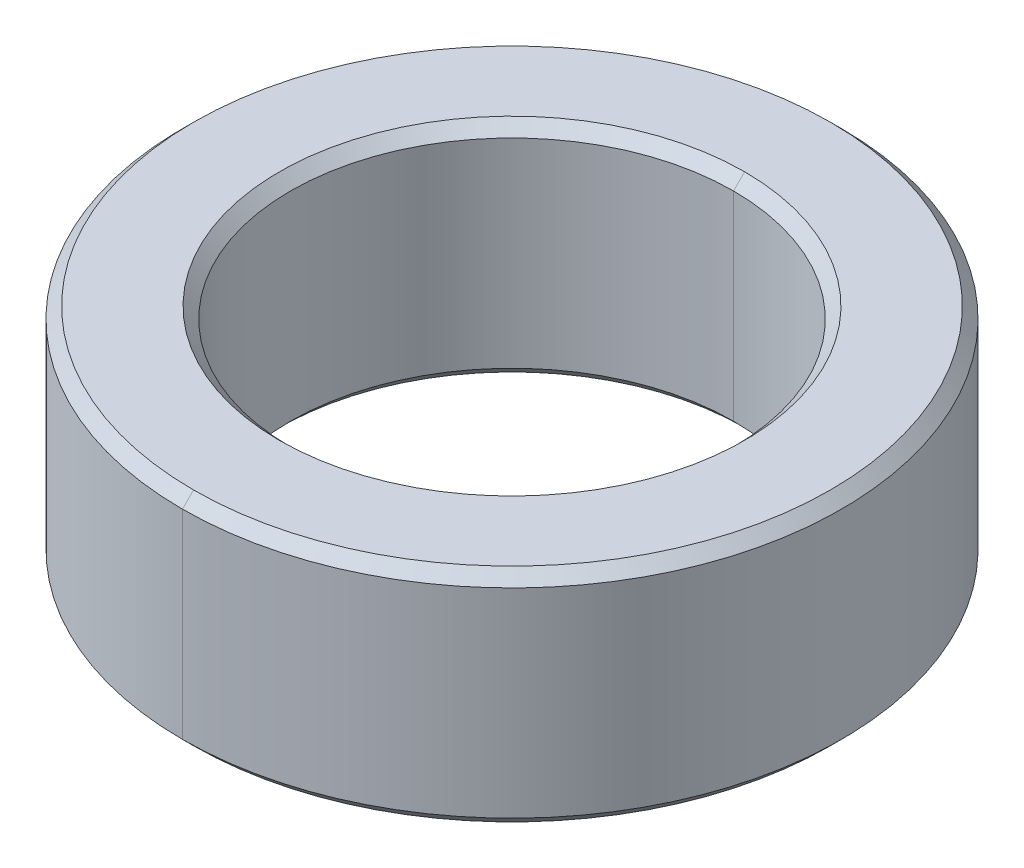
ISO-10303-21;
HEADER;
FILE_DESCRIPTION(('STEP AP214'),'2;1');
FILE_NAME('part.step','',(''),(''),'','','');
FILE_SCHEMA(('AUTOMOTIVE_DESIGN { 1 0 10303 214 1 1 1 1 }'));
ENDSEC;
DATA;
#1=APPLICATION_CONTEXT('core data for automotive mechanical design processes');
#2=APPLICATION_PROTOCOL_DEFINITION('international standard','automotive_design',2000,#1);
#3=PRODUCT_CONTEXT('',#1,'mechanical');
#4=PRODUCT('Part','Part','',(#3));
#5=PRODUCT_RELATED_PRODUCT_CATEGORY('part','',(#4));
#6=PRODUCT_DEFINITION_FORMATION('','',#4);
#7=PRODUCT_DEFINITION_CONTEXT('part definition',#1,'design');
#8=PRODUCT_DEFINITION('design','',#6,#7);
#9=PRODUCT_DEFINITION_SHAPE('','',#8);
#10=(LENGTH_UNIT() NAMED_UNIT(*) SI_UNIT(.MILLI.,.METRE.));
#11=(NAMED_UNIT(*) PLANE_ANGLE_UNIT() SI_UNIT($,.RADIAN.));
#12=(NAMED_UNIT(*) SI_UNIT($,.STERADIAN.) SOLID_ANGLE_UNIT());
#13=UNCERTAINTY_MEASURE_WITH_UNIT(LENGTH_MEASURE(1.E-05),#10,'distance_accuracy_value','');
#14=(GEOMETRIC_REPRESENTATION_CONTEXT(3) GLOBAL_UNCERTAINTY_ASSIGNED_CONTEXT((#13)) GLOBAL_UNIT_ASSIGNED_CONTEXT((#10,
#11,#12)) REPRESENTATION_CONTEXT('',''));
#15=CARTESIAN_POINT('',(0.,0.,0.));
#16=DIRECTION('',(0.,0.,1.));
#17=DIRECTION('',(1.,0.,0.));
#18=AXIS2_PLACEMENT_3D('',#15,#16,#17);
#19=CARTESIAN_POINT('',(0.,0.9,0.));
#20=DIRECTION('',(0.,1.,0.));
#21=DIRECTION('',(0.,0.,1.));
#22=AXIS2_PLACEMENT_3D('',#19,#20,#21);
#23=CONICAL_SURFACE('',#22,2.,0.785398163397459);
#24=DIRECTION('',(0.,0.70710678118654,-0.707106781186555));
#25=VECTOR('',#24,1.);
#26=CARTESIAN_POINT('',(0.,0.9,-2.));
#27=LINE('',#26,#25);
#28=CARTESIAN_POINT('',(0.,0.9,-2.));
#29=VERTEX_POINT('',#28);
#30=CARTESIAN_POINT('',(0.,1.,-2.1));
#31=VERTEX_POINT('',#30);
#32=EDGE_CURVE('E158',#29,#31,#27,.T.);
#33=ORIENTED_EDGE('',*,*,#32,.F.);
#34=CARTESIAN_POINT('',(0.,0.9,0.));
#35=DIRECTION('',(0.,1.,0.));
#36=DIRECTION('',(0.,0.,1.));
#37=AXIS2_PLACEMENT_3D('',#34,#35,#36);
#38=CIRCLE('',#37,2.);
#39=CARTESIAN_POINT('',(0.,0.9,2.));
#40=VERTEX_POINT('',#39);
#41=EDGE_CURVE('E27',#40,#29,#38,.T.);
#42=ORIENTED_EDGE('',*,*,#41,.F.);
#43=DIRECTION('',(0.,0.70710678118654,0.707106781186555));
#44=VECTOR('',#43,1.);
#45=CARTESIAN_POINT('',(0.,0.9,2.));
#46=LINE('',#45,#44);
#47=CARTESIAN_POINT('',(0.,1.,2.1));
#48=VERTEX_POINT('',#47);
#49=EDGE_CURVE('E114',#40,#48,#46,.T.);
#50=ORIENTED_EDGE('',*,*,#49,.T.);
#51=CARTESIAN_POINT('',(0.,1.,0.));
#52=DIRECTION('',(0.,-1.,0.));
#53=DIRECTION('',(0.,0.,1.));
#54=AXIS2_PLACEMENT_3D('',#51,#52,#53);
#55=CIRCLE('',#54,2.1);
#56=EDGE_CURVE('E20',#31,#48,#55,.T.);
#57=ORIENTED_EDGE('',*,*,#56,.F.);
#58=EDGE_LOOP('',(#33,#42,#50,#57));
#59=FACE_BOUND('',#58,.T.);
#60=ADVANCED_FACE('F16',(#59),#23,.F.);
#61=CARTESIAN_POINT('',(0.,-1.,0.));
#62=DIRECTION('',(0.,-1.,0.));
#63=DIRECTION('',(0.,0.,-1.));
#64=AXIS2_PLACEMENT_3D('',#61,#62,#63);
#65=CONICAL_SURFACE('',#64,2.1,0.785398163397448);
#66=DIRECTION('',(0.,-0.707106781186548,0.707106781186548));
#67=VECTOR('',#66,1.);
#68=CARTESIAN_POINT('',(0.,-1.,2.1));
#69=LINE('',#68,#67);
#70=CARTESIAN_POINT('',(0.,-0.9,2.));
#71=VERTEX_POINT('',#70);
#72=CARTESIAN_POINT('',(0.,-1.,2.1));
#73=VERTEX_POINT('',#72);
#74=EDGE_CURVE('E101',#71,#73,#69,.T.);
#75=ORIENTED_EDGE('',*,*,#74,.F.);
#76=CARTESIAN_POINT('',(0.,-0.9,0.));
#77=DIRECTION('',(0.,-1.,0.));
#78=DIRECTION('',(0.,0.,1.));
#79=AXIS2_PLACEMENT_3D('',#76,#77,#78);
#80=CIRCLE('',#79,2.);
#81=CARTESIAN_POINT('',(0.,-0.9,-2.));
#82=VERTEX_POINT('',#81);
#83=EDGE_CURVE('E10',#82,#71,#80,.T.);
#84=ORIENTED_EDGE('',*,*,#83,.F.);
#85=DIRECTION('',(0.,-0.707106781186548,-0.707106781186548));
#86=VECTOR('',#85,1.);
#87=CARTESIAN_POINT('',(0.,-1.,-2.1));
#88=LINE('',#87,#86);
#89=CARTESIAN_POINT('',(0.,-1.,-2.1));
#90=VERTEX_POINT('',#89);
#91=EDGE_CURVE('E112',#82,#90,#88,.T.);
#92=ORIENTED_EDGE('',*,*,#91,.T.);
#93=CARTESIAN_POINT('',(0.,-1.,0.));
#94=DIRECTION('',(0.,1.,0.));
#95=DIRECTION('',(0.,0.,1.));
#96=AXIS2_PLACEMENT_3D('',#93,#94,#95);
#97=CIRCLE('',#96,2.1);
#98=EDGE_CURVE('E104',#73,#90,#97,.T.);
#99=ORIENTED_EDGE('',*,*,#98,.F.);
#100=EDGE_LOOP('',(#75,#84,#92,#99));
#101=FACE_BOUND('',#100,.T.);
#102=ADVANCED_FACE('F102',(#101),#65,.F.);
#103=CARTESIAN_POINT('',(0.,1.,0.));
#104=DIRECTION('',(0.,-1.,0.));
#105=DIRECTION('',(0.,0.,-1.));
#106=AXIS2_PLACEMENT_3D('',#103,#104,#105);
#107=CONICAL_SURFACE('',#106,2.875,0.785398163397448);
#108=DIRECTION('',(0.,-0.707106781186548,0.707106781186548));
#109=VECTOR('',#108,1.);
#110=CARTESIAN_POINT('',(0.,1.,2.875));
#111=LINE('',#110,#109);
#112=CARTESIAN_POINT('',(0.,1.,2.875));
#113=VERTEX_POINT('',#112);
#114=CARTESIAN_POINT('',(0.,0.9,2.975));
#115=VERTEX_POINT('',#114);
#116=EDGE_CURVE('E136',#113,#115,#111,.T.);
#117=ORIENTED_EDGE('',*,*,#116,.F.);
#118=CARTESIAN_POINT('',(0.,1.,0.));
#119=DIRECTION('',(0.,1.,0.));
#120=DIRECTION('',(0.,0.,1.));
#121=AXIS2_PLACEMENT_3D('',#118,#119,#120);
#122=CIRCLE('',#121,2.875);
#123=CARTESIAN_POINT('',(0.,1.,-2.875));
#124=VERTEX_POINT('',#123);
#125=EDGE_CURVE('E129',#124,#113,#122,.T.);
#126=ORIENTED_EDGE('',*,*,#125,.F.);
#127=DIRECTION('',(0.,-0.707106781186548,-0.707106781186548));
#128=VECTOR('',#127,1.);
#129=CARTESIAN_POINT('',(0.,1.,-2.875));
#130=LINE('',#129,#128);
#131=CARTESIAN_POINT('',(0.,0.9,-2.975));
#132=VERTEX_POINT('',#131);
#133=EDGE_CURVE('E135',#124,#132,#130,.T.);
#134=ORIENTED_EDGE('',*,*,#133,.T.);
#135=CARTESIAN_POINT('',(0.,0.9,0.));
#136=DIRECTION('',(0.,-1.,0.));
#137=DIRECTION('',(0.,0.,1.));
#138=AXIS2_PLACEMENT_3D('',#135,#136,#137);
#139=CIRCLE('',#138,2.975);
#140=EDGE_CURVE('E155',#115,#132,#139,.T.);
#141=ORIENTED_EDGE('',*,*,#140,.F.);
#142=EDGE_LOOP('',(#117,#126,#134,#141));
#143=FACE_BOUND('',#142,.T.);
#144=ADVANCED_FACE('F203',(#143),#107,.T.);
#145=CARTESIAN_POINT('',(0.,-0.9,0.));
#146=DIRECTION('',(0.,1.,0.));
#147=DIRECTION('',(0.,0.,1.));
#148=AXIS2_PLACEMENT_3D('',#145,#146,#147);
#149=CONICAL_SURFACE('',#148,2.975,0.785398163397453);
#150=DIRECTION('',(0.,0.707106781186544,-0.707106781186551));
#151=VECTOR('',#150,1.);
#152=CARTESIAN_POINT('',(0.,-0.9,-2.975));
#153=LINE('',#152,#151);
#154=CARTESIAN_POINT('',(0.,-1.,-2.875));
#155=VERTEX_POINT('',#154);
#156=CARTESIAN_POINT('',(0.,-0.9,-2.975));
#157=VERTEX_POINT('',#156);
#158=EDGE_CURVE('E137',#155,#157,#153,.T.);
#159=ORIENTED_EDGE('',*,*,#158,.F.);
#160=CARTESIAN_POINT('',(0.,-1.,0.));
#161=DIRECTION('',(0.,-1.,0.));
#162=DIRECTION('',(0.,0.,1.));
#163=AXIS2_PLACEMENT_3D('',#160,#161,#162);
#164=CIRCLE('',#163,2.875);
#165=CARTESIAN_POINT('',(0.,-1.,2.875));
#166=VERTEX_POINT('',#165);
#167=EDGE_CURVE('E162',#166,#155,#164,.T.);
#168=ORIENTED_EDGE('',*,*,#167,.F.);
#169=DIRECTION('',(0.,0.707106781186544,0.707106781186551));
#170=VECTOR('',#169,1.);
#171=CARTESIAN_POINT('',(0.,-0.9,2.975));
#172=LINE('',#171,#170);
#173=CARTESIAN_POINT('',(0.,-0.9,2.975));
#174=VERTEX_POINT('',#173);
#175=EDGE_CURVE('E97',#166,#174,#172,.T.);
#176=ORIENTED_EDGE('',*,*,#175,.T.);
#177=CARTESIAN_POINT('',(0.,-0.9,0.));
#178=DIRECTION('',(0.,1.,0.));
#179=DIRECTION('',(0.,0.,1.));
#180=AXIS2_PLACEMENT_3D('',#177,#178,#179);
#181=CIRCLE('',#180,2.975);
#182=EDGE_CURVE('E42',#157,#174,#181,.T.);
#183=ORIENTED_EDGE('',*,*,#182,.F.);
#184=EDGE_LOOP('',(#159,#168,#176,#183));
#185=FACE_BOUND('',#184,.T.);
#186=ADVANCED_FACE('F18',(#185),#149,.T.);
#187=CARTESIAN_POINT('',(0.,1.,0.));
#188=DIRECTION('',(0.,-1.,0.));
#189=DIRECTION('',(0.,0.,-1.));
#190=AXIS2_PLACEMENT_3D('',#187,#188,#189);
#191=CYLINDRICAL_SURFACE('',#190,2.);
#192=DIRECTION('',(0.,-1.,0.));
#193=VECTOR('',#192,1.);
#194=CARTESIAN_POINT('',(0.,1.,2.));
#195=LINE('',#194,#193);
#196=EDGE_CURVE('E80',#40,#71,#195,.T.);
#197=ORIENTED_EDGE('',*,*,#196,.F.);
#198=ORIENTED_EDGE('',*,*,#41,.T.);
#199=DIRECTION('',(0.,-1.,0.));
#200=VECTOR('',#199,1.);
#201=CARTESIAN_POINT('',(0.,1.,-2.));
#202=LINE('',#201,#200);
#203=EDGE_CURVE('E83',#29,#82,#202,.T.);
#204=ORIENTED_EDGE('',*,*,#203,.T.);
#205=ORIENTED_EDGE('',*,*,#83,.T.);
#206=EDGE_LOOP('',(#197,#198,#204,#205));
#207=FACE_BOUND('',#206,.T.);
#208=ADVANCED_FACE('F77',(#207),#191,.F.);
#209=CARTESIAN_POINT('',(0.,1.,0.));
#210=DIRECTION('',(0.,-1.,0.));
#211=DIRECTION('',(0.,0.,-1.));
#212=AXIS2_PLACEMENT_3D('',#209,#210,#211);
#213=CYLINDRICAL_SURFACE('',#212,2.975);
#214=DIRECTION('',(0.,-1.,0.));
#215=VECTOR('',#214,1.);
#216=CARTESIAN_POINT('',(0.,1.,2.975));
#217=LINE('',#216,#215);
#218=EDGE_CURVE('E130',#115,#174,#217,.T.);
#219=ORIENTED_EDGE('',*,*,#218,.F.);
#220=ORIENTED_EDGE('',*,*,#140,.T.);
#221=DIRECTION('',(0.,-1.,0.));
#222=VECTOR('',#221,1.);
#223=CARTESIAN_POINT('',(0.,1.,-2.975));
#224=LINE('',#223,#222);
#225=EDGE_CURVE('E127',#132,#157,#224,.T.);
#226=ORIENTED_EDGE('',*,*,#225,.T.);
#227=ORIENTED_EDGE('',*,*,#182,.T.);
#228=EDGE_LOOP('',(#219,#220,#226,#227));
#229=FACE_BOUND('',#228,.T.);
#230=ADVANCED_FACE('F194',(#229),#213,.T.);
#231=CARTESIAN_POINT('',(0.,-1.,0.));
#232=DIRECTION('',(0.,1.,0.));
#233=DIRECTION('',(1.,0.,0.));
#234=AXIS2_PLACEMENT_3D('',#231,#232,#233);
#235=PLANE('',#234);
#236=CARTESIAN_POINT('',(0.,-1.,0.));
#237=DIRECTION('',(0.,1.,0.));
#238=DIRECTION('',(0.,0.,1.));
#239=AXIS2_PLACEMENT_3D('',#236,#237,#238);
#240=CIRCLE('',#239,2.1);
#241=EDGE_CURVE('E109',#90,#73,#240,.T.);
#242=ORIENTED_EDGE('',*,*,#241,.T.);
#243=ORIENTED_EDGE('',*,*,#98,.T.);
#244=EDGE_LOOP('',(#242,#243));
#245=FACE_BOUND('',#244,.T.);
#246=ORIENTED_EDGE('',*,*,#167,.T.);
#247=CARTESIAN_POINT('',(0.,-1.,0.));
#248=DIRECTION('',(0.,-1.,0.));
#249=DIRECTION('',(0.,0.,1.));
#250=AXIS2_PLACEMENT_3D('',#247,#248,#249);
#251=CIRCLE('',#250,2.875);
#252=EDGE_CURVE('E142',#155,#166,#251,.T.);
#253=ORIENTED_EDGE('',*,*,#252,.T.);
#254=EDGE_LOOP('',(#246,#253));
#255=FACE_BOUND('',#254,.T.);
#256=ADVANCED_FACE('F235',(#245,#255),#235,.F.);
#257=CARTESIAN_POINT('',(0.,1.,0.));
#258=DIRECTION('',(0.,1.,0.));
#259=DIRECTION('',(1.,0.,0.));
#260=AXIS2_PLACEMENT_3D('',#257,#258,#259);
#261=PLANE('',#260);
#262=CARTESIAN_POINT('',(0.,1.,0.));
#263=DIRECTION('',(0.,-1.,0.));
#264=DIRECTION('',(0.,0.,1.));
#265=AXIS2_PLACEMENT_3D('',#262,#263,#264);
#266=CIRCLE('',#265,2.1);
#267=EDGE_CURVE('E122',#48,#31,#266,.T.);
#268=ORIENTED_EDGE('',*,*,#267,.T.);
#269=ORIENTED_EDGE('',*,*,#56,.T.);
#270=EDGE_LOOP('',(#268,#269));
#271=FACE_BOUND('',#270,.T.);
#272=ORIENTED_EDGE('',*,*,#125,.T.);
#273=CARTESIAN_POINT('',(0.,1.,0.));
#274=DIRECTION('',(0.,1.,0.));
#275=DIRECTION('',(0.,0.,1.));
#276=AXIS2_PLACEMENT_3D('',#273,#274,#275);
#277=CIRCLE('',#276,2.875);
#278=EDGE_CURVE('E171',#113,#124,#277,.T.);
#279=ORIENTED_EDGE('',*,*,#278,.T.);
#280=EDGE_LOOP('',(#272,#279));
#281=FACE_BOUND('',#280,.T.);
#282=ADVANCED_FACE('F237',(#271,#281),#261,.T.);
#283=CARTESIAN_POINT('',(0.,1.,0.));
#284=DIRECTION('',(0.,-1.,0.));
#285=DIRECTION('',(0.,0.,-1.));
#286=AXIS2_PLACEMENT_3D('',#283,#284,#285);
#287=CYLINDRICAL_SURFACE('',#286,2.975);
#288=CARTESIAN_POINT('',(0.,0.9,0.));
#289=DIRECTION('',(0.,-1.,0.));
#290=DIRECTION('',(0.,0.,1.));
#291=AXIS2_PLACEMENT_3D('',#288,#289,#290);
#292=CIRCLE('',#291,2.975);
#293=EDGE_CURVE('E131',#132,#115,#292,.T.);
#294=ORIENTED_EDGE('',*,*,#293,.T.);
#295=ORIENTED_EDGE('',*,*,#218,.T.);
#296=CARTESIAN_POINT('',(0.,-0.9,0.));
#297=DIRECTION('',(0.,1.,0.));
#298=DIRECTION('',(0.,0.,1.));
#299=AXIS2_PLACEMENT_3D('',#296,#297,#298);
#300=CIRCLE('',#299,2.975);
#301=EDGE_CURVE('E141',#174,#157,#300,.T.);
#302=ORIENTED_EDGE('',*,*,#301,.T.);
#303=ORIENTED_EDGE('',*,*,#225,.F.);
#304=EDGE_LOOP('',(#294,#295,#302,#303));
#305=FACE_BOUND('',#304,.T.);
#306=ADVANCED_FACE('F199',(#305),#287,.T.);
#307=CARTESIAN_POINT('',(0.,1.,0.));
#308=DIRECTION('',(0.,-1.,0.));
#309=DIRECTION('',(0.,0.,-1.));
#310=AXIS2_PLACEMENT_3D('',#307,#308,#309);
#311=CYLINDRICAL_SURFACE('',#310,2.);
#312=CARTESIAN_POINT('',(0.,0.9,0.));
#313=DIRECTION('',(0.,1.,0.));
#314=DIRECTION('',(0.,0.,1.));
#315=AXIS2_PLACEMENT_3D('',#312,#313,#314);
#316=CIRCLE('',#315,2.);
#317=EDGE_CURVE('E95',#29,#40,#316,.T.);
#318=ORIENTED_EDGE('',*,*,#317,.T.);
#319=ORIENTED_EDGE('',*,*,#196,.T.);
#320=CARTESIAN_POINT('',(0.,-0.9,0.));
#321=DIRECTION('',(0.,-1.,0.));
#322=DIRECTION('',(0.,0.,1.));
#323=AXIS2_PLACEMENT_3D('',#320,#321,#322);
#324=CIRCLE('',#323,2.);
#325=EDGE_CURVE('E93',#71,#82,#324,.T.);
#326=ORIENTED_EDGE('',*,*,#325,.T.);
#327=ORIENTED_EDGE('',*,*,#203,.F.);
#328=EDGE_LOOP('',(#318,#319,#326,#327));
#329=FACE_BOUND('',#328,.T.);
#330=ADVANCED_FACE('F91',(#329),#311,.F.);
#331=CARTESIAN_POINT('',(0.,-0.9,0.));
#332=DIRECTION('',(0.,1.,0.));
#333=DIRECTION('',(0.,0.,1.));
#334=AXIS2_PLACEMENT_3D('',#331,#332,#333);
#335=CONICAL_SURFACE('',#334,2.975,0.785398163397453);
#336=ORIENTED_EDGE('',*,*,#252,.F.);
#337=ORIENTED_EDGE('',*,*,#158,.T.);
#338=ORIENTED_EDGE('',*,*,#301,.F.);
#339=ORIENTED_EDGE('',*,*,#175,.F.);
#340=EDGE_LOOP('',(#336,#337,#338,#339));
#341=FACE_BOUND('',#340,.T.);
#342=ADVANCED_FACE('F234',(#341),#335,.T.);
#343=CARTESIAN_POINT('',(0.,1.,0.));
#344=DIRECTION('',(0.,-1.,0.));
#345=DIRECTION('',(0.,0.,-1.));
#346=AXIS2_PLACEMENT_3D('',#343,#344,#345);
#347=CONICAL_SURFACE('',#346,2.875,0.785398163397448);
#348=ORIENTED_EDGE('',*,*,#278,.F.);
#349=ORIENTED_EDGE('',*,*,#116,.T.);
#350=ORIENTED_EDGE('',*,*,#293,.F.);
#351=ORIENTED_EDGE('',*,*,#133,.F.);
#352=EDGE_LOOP('',(#348,#349,#350,#351));
#353=FACE_BOUND('',#352,.T.);
#354=ADVANCED_FACE('F206',(#353),#347,.T.);
#355=CARTESIAN_POINT('',(0.,-1.,0.));
#356=DIRECTION('',(0.,-1.,0.));
#357=DIRECTION('',(0.,0.,-1.));
#358=AXIS2_PLACEMENT_3D('',#355,#356,#357);
#359=CONICAL_SURFACE('',#358,2.1,0.785398163397448);
#360=ORIENTED_EDGE('',*,*,#325,.F.);
#361=ORIENTED_EDGE('',*,*,#74,.T.);
#362=ORIENTED_EDGE('',*,*,#241,.F.);
#363=ORIENTED_EDGE('',*,*,#91,.F.);
#364=EDGE_LOOP('',(#360,#361,#362,#363));
#365=FACE_BOUND('',#364,.T.);
#366=ADVANCED_FACE('F111',(#365),#359,.F.);
#367=CARTESIAN_POINT('',(0.,0.9,0.));
#368=DIRECTION('',(0.,1.,0.));
#369=DIRECTION('',(0.,0.,1.));
#370=AXIS2_PLACEMENT_3D('',#367,#368,#369);
#371=CONICAL_SURFACE('',#370,2.,0.785398163397459);
#372=ORIENTED_EDGE('',*,*,#317,.F.);
#373=ORIENTED_EDGE('',*,*,#32,.T.);
#374=ORIENTED_EDGE('',*,*,#267,.F.);
#375=ORIENTED_EDGE('',*,*,#49,.F.);
#376=EDGE_LOOP('',(#372,#373,#374,#375));
#377=FACE_BOUND('',#376,.T.);
#378=ADVANCED_FACE('F257',(#377),#371,.F.);
#379=CLOSED_SHELL('',(#60,#102,#144,#186,#208,#230,#256,#282,#306,#330,#342,#354,#366,#378));
#380=MANIFOLD_SOLID_BREP('B1',#379);
#381=ADVANCED_BREP_SHAPE_REPRESENTATION('',(#18,#380),#14);
#382=SHAPE_DEFINITION_REPRESENTATION(#9,#381);
ENDSEC;
END-ISO-10303-21;
